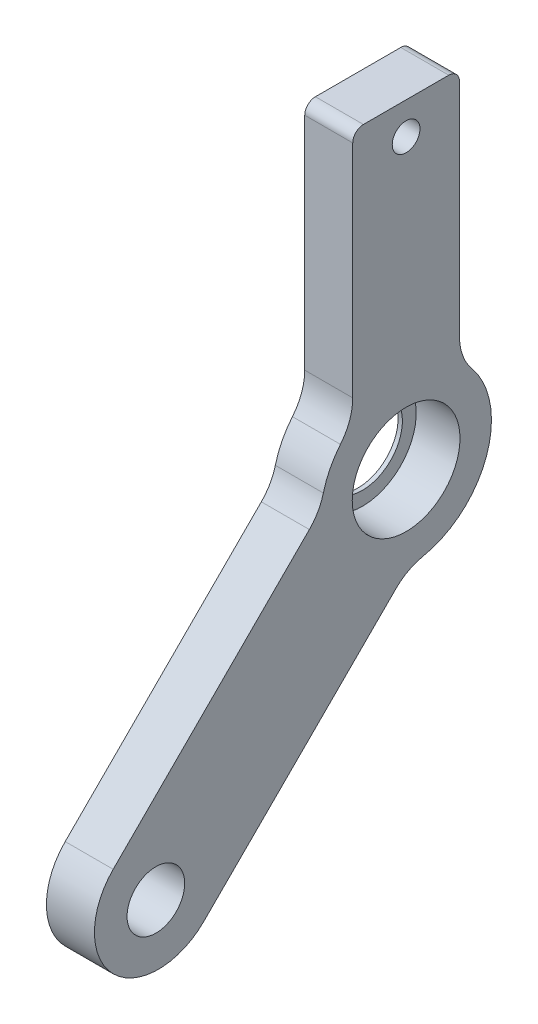
ISO-10303-21;
HEADER;
FILE_DESCRIPTION(('STEP AP214'),'2;1');
FILE_NAME('part.step','',(''),(''),'','','');
FILE_SCHEMA(('AUTOMOTIVE_DESIGN { 1 0 10303 214 1 1 1 1 }'));
ENDSEC;
DATA;
#1=APPLICATION_CONTEXT('core data for automotive mechanical design processes');
#2=APPLICATION_PROTOCOL_DEFINITION('international standard','automotive_design',2000,#1);
#3=PRODUCT_CONTEXT('',#1,'mechanical');
#4=PRODUCT('Part','Part','',(#3));
#5=PRODUCT_RELATED_PRODUCT_CATEGORY('part','',(#4));
#6=PRODUCT_DEFINITION_FORMATION('','',#4);
#7=PRODUCT_DEFINITION_CONTEXT('part definition',#1,'design');
#8=PRODUCT_DEFINITION('design','',#6,#7);
#9=PRODUCT_DEFINITION_SHAPE('','',#8);
#10=(LENGTH_UNIT() NAMED_UNIT(*) SI_UNIT(.MILLI.,.METRE.));
#11=(NAMED_UNIT(*) PLANE_ANGLE_UNIT() SI_UNIT($,.RADIAN.));
#12=(NAMED_UNIT(*) SI_UNIT($,.STERADIAN.) SOLID_ANGLE_UNIT());
#13=UNCERTAINTY_MEASURE_WITH_UNIT(LENGTH_MEASURE(1.E-05),#10,'distance_accuracy_value','');
#14=(GEOMETRIC_REPRESENTATION_CONTEXT(3) GLOBAL_UNCERTAINTY_ASSIGNED_CONTEXT((#13)) GLOBAL_UNIT_ASSIGNED_CONTEXT((#10,
#11,#12)) REPRESENTATION_CONTEXT('',''));
#15=CARTESIAN_POINT('',(0.,0.,0.));
#16=DIRECTION('',(0.,0.,1.));
#17=DIRECTION('',(1.,0.,0.));
#18=AXIS2_PLACEMENT_3D('',#15,#16,#17);
#19=CARTESIAN_POINT('',(-2.25,-22.9735992364267,23.2093014968222));
#20=DIRECTION('',(1.,0.,0.));
#21=DIRECTION('',(0.,0.,-1.));
#22=AXIS2_PLACEMENT_3D('',#19,#20,#21);
#23=PLANE('',#22);
#24=CARTESIAN_POINT('',(-2.25,-22.9735992364267,23.2093014968222));
#25=DIRECTION('',(-1.,0.,0.));
#26=DIRECTION('',(0.,0.,-1.));
#27=AXIS2_PLACEMENT_3D('',#24,#25,#26);
#28=CIRCLE('',#27,6.);
#29=CARTESIAN_POINT('',(-2.25,-27.216239923546,18.9666608097029));
#30=VERTEX_POINT('',#29);
#31=CARTESIAN_POINT('',(-2.25,-18.7309585493074,27.4519421839415));
#32=VERTEX_POINT('',#31);
#33=EDGE_CURVE('E195',#30,#32,#28,.T.);
#34=ORIENTED_EDGE('',*,*,#33,.T.);
#35=DIRECTION('',(0.,0.707106781186548,-0.707106781186548));
#36=VECTOR('',#35,1.);
#37=CARTESIAN_POINT('',(-2.25,-0.346181931497273,9.06716556613136));
#38=LINE('',#37,#36);
#39=CARTESIAN_POINT('',(-2.25,-0.346181931497273,9.06716556613136));
#40=VERTEX_POINT('',#39);
#41=EDGE_CURVE('E113',#32,#40,#38,.T.);
#42=ORIENTED_EDGE('',*,*,#41,.T.);
#43=CARTESIAN_POINT('',(-2.25,3.18935197443546,12.6026994720641));
#44=DIRECTION('',(1.,0.,0.));
#45=DIRECTION('',(0.,0.,-1.));
#46=AXIS2_PLACEMENT_3D('',#43,#44,#45);
#47=CIRCLE('',#46,5.);
#48=CARTESIAN_POINT('',(-2.25,1.96267813811413,7.75550736742406));
#49=VERTEX_POINT('',#48);
#50=EDGE_CURVE('E229',#40,#49,#47,.T.);
#51=ORIENTED_EDGE('',*,*,#50,.T.);
#52=CARTESIAN_POINT('',(-2.25,0.,0.));
#53=DIRECTION('',(-1.,0.,0.));
#54=DIRECTION('',(0.,0.,1.));
#55=AXIS2_PLACEMENT_3D('',#52,#53,#54);
#56=CIRCLE('',#55,8.);
#57=CARTESIAN_POINT('',(-2.25,5.11176853102651,6.15384615384616));
#58=VERTEX_POINT('',#57);
#59=EDGE_CURVE('E248',#49,#58,#56,.T.);
#60=ORIENTED_EDGE('',*,*,#59,.T.);
#61=CARTESIAN_POINT('',(-2.25,8.30662386291807,10.));
#62=DIRECTION('',(1.,0.,0.));
#63=DIRECTION('',(0.,0.,1.));
#64=AXIS2_PLACEMENT_3D('',#61,#62,#63);
#65=CIRCLE('',#64,5.);
#66=CARTESIAN_POINT('',(-2.25,8.30662386291807,5.));
#67=VERTEX_POINT('',#66);
#68=EDGE_CURVE('E245',#58,#67,#65,.T.);
#69=ORIENTED_EDGE('',*,*,#68,.T.);
#70=DIRECTION('',(0.,1.,0.));
#71=VECTOR('',#70,1.);
#72=CARTESIAN_POINT('',(-2.25,8.30662386291807,5.));
#73=LINE('',#72,#71);
#74=CARTESIAN_POINT('',(-2.25,29.,5.));
#75=VERTEX_POINT('',#74);
#76=EDGE_CURVE('E247',#67,#75,#73,.T.);
#77=ORIENTED_EDGE('',*,*,#76,.T.);
#78=CARTESIAN_POINT('',(-2.25,29.,4.));
#79=DIRECTION('',(-1.,0.,0.));
#80=DIRECTION('',(0.,0.,1.));
#81=AXIS2_PLACEMENT_3D('',#78,#79,#80);
#82=CIRCLE('',#81,0.999999999999999);
#83=CARTESIAN_POINT('',(-2.25,30.,4.));
#84=VERTEX_POINT('',#83);
#85=EDGE_CURVE('E250',#75,#84,#82,.T.);
#86=ORIENTED_EDGE('',*,*,#85,.T.);
#87=DIRECTION('',(0.,0.,-1.));
#88=VECTOR('',#87,1.);
#89=CARTESIAN_POINT('',(-2.25,30.,-4.));
#90=LINE('',#89,#88);
#91=CARTESIAN_POINT('',(-2.25,30.,-4.));
#92=VERTEX_POINT('',#91);
#93=EDGE_CURVE('E256',#84,#92,#90,.T.);
#94=ORIENTED_EDGE('',*,*,#93,.T.);
#95=CARTESIAN_POINT('',(-2.25,29.,-4.));
#96=DIRECTION('',(-1.,0.,0.));
#97=DIRECTION('',(0.,0.,-1.));
#98=AXIS2_PLACEMENT_3D('',#95,#96,#97);
#99=CIRCLE('',#98,0.999999999999999);
#100=CARTESIAN_POINT('',(-2.25,29.,-5.));
#101=VERTEX_POINT('',#100);
#102=EDGE_CURVE('E258',#92,#101,#99,.T.);
#103=ORIENTED_EDGE('',*,*,#102,.T.);
#104=DIRECTION('',(0.,-1.,0.));
#105=VECTOR('',#104,1.);
#106=CARTESIAN_POINT('',(-2.25,8.30662386291807,-5.));
#107=LINE('',#106,#105);
#108=CARTESIAN_POINT('',(-2.25,8.30662386291807,-5.));
#109=VERTEX_POINT('',#108);
#110=EDGE_CURVE('E260',#101,#109,#107,.T.);
#111=ORIENTED_EDGE('',*,*,#110,.T.);
#112=CARTESIAN_POINT('',(-2.25,8.30662386291807,-10.));
#113=DIRECTION('',(1.,0.,0.));
#114=DIRECTION('',(0.,0.,-1.));
#115=AXIS2_PLACEMENT_3D('',#112,#113,#114);
#116=CIRCLE('',#115,5.);
#117=CARTESIAN_POINT('',(-2.25,5.11176853102651,-6.15384615384615));
#118=VERTEX_POINT('',#117);
#119=EDGE_CURVE('E150',#109,#118,#116,.T.);
#120=ORIENTED_EDGE('',*,*,#119,.T.);
#121=CARTESIAN_POINT('',(-2.25,0.,0.));
#122=DIRECTION('',(-1.,0.,0.));
#123=DIRECTION('',(0.,0.,1.));
#124=AXIS2_PLACEMENT_3D('',#121,#122,#123);
#125=CIRCLE('',#124,8.);
#126=CARTESIAN_POINT('',(-2.25,-7.8409890477926,-1.58710136802803));
#127=VERTEX_POINT('',#126);
#128=EDGE_CURVE('E144',#118,#127,#125,.T.);
#129=ORIENTED_EDGE('',*,*,#128,.T.);
#130=CARTESIAN_POINT('',(-2.25,-12.741607202663,-2.57903972304555));
#131=DIRECTION('',(1.,0.,0.));
#132=DIRECTION('',(0.,0.,1.));
#133=AXIS2_PLACEMENT_3D('',#130,#131,#132);
#134=CIRCLE('',#133,5.);
#135=CARTESIAN_POINT('',(-2.25,-9.20607329673024,0.956494182887188));
#136=VERTEX_POINT('',#135);
#137=EDGE_CURVE('E148',#127,#136,#134,.T.);
#138=ORIENTED_EDGE('',*,*,#137,.T.);
#139=DIRECTION('',(0.,-0.707106781186547,0.707106781186548));
#140=VECTOR('',#139,1.);
#141=CARTESIAN_POINT('',(-2.25,-9.20607329673024,0.956494182887187));
#142=LINE('',#141,#140);
#143=EDGE_CURVE('E52',#136,#30,#142,.T.);
#144=ORIENTED_EDGE('',*,*,#143,.T.);
#145=EDGE_LOOP('',(#34,#42,#51,#60,#69,#77,#86,#94,#103,#111,#120,#129,#138,#144));
#146=FACE_BOUND('',#145,.T.);
#147=CARTESIAN_POINT('',(-2.25,0.,0.));
#148=DIRECTION('',(-1.,0.,0.));
#149=DIRECTION('',(0.,0.,1.));
#150=AXIS2_PLACEMENT_3D('',#147,#148,#149);
#151=CIRCLE('',#150,3.75);
#152=CARTESIAN_POINT('',(-2.25,0.,3.75));
#153=VERTEX_POINT('',#152);
#154=EDGE_CURVE('E172',#153,#153,#151,.T.);
#155=ORIENTED_EDGE('',*,*,#154,.F.);
#156=EDGE_LOOP('',(#155));
#157=FACE_BOUND('',#156,.T.);
#158=CARTESIAN_POINT('',(-2.25,27.,0.));
#159=DIRECTION('',(-1.,0.,0.));
#160=DIRECTION('',(0.,0.,1.));
#161=AXIS2_PLACEMENT_3D('',#158,#159,#160);
#162=CIRCLE('',#161,1.3);
#163=CARTESIAN_POINT('',(-2.25,27.,1.3));
#164=VERTEX_POINT('',#163);
#165=EDGE_CURVE('E328',#164,#164,#162,.T.);
#166=ORIENTED_EDGE('',*,*,#165,.F.);
#167=EDGE_LOOP('',(#166));
#168=FACE_BOUND('',#167,.T.);
#169=CARTESIAN_POINT('',(-2.25,-23.2163750431964,23.4520773035919));
#170=DIRECTION('',(-1.,0.,0.));
#171=DIRECTION('',(0.,0.,1.));
#172=AXIS2_PLACEMENT_3D('',#169,#170,#171);
#173=CIRCLE('',#172,2.7);
#174=CARTESIAN_POINT('',(-2.25,-23.2163750431964,26.1520773035919));
#175=VERTEX_POINT('',#174);
#176=EDGE_CURVE('E322',#175,#175,#173,.T.);
#177=ORIENTED_EDGE('',*,*,#176,.F.);
#178=EDGE_LOOP('',(#177));
#179=FACE_BOUND('',#178,.T.);
#180=ADVANCED_FACE('F34',(#146,#157,#168,#179),#23,.F.);
#181=CARTESIAN_POINT('',(2.25,-22.9735992364267,23.2093014968222));
#182=DIRECTION('',(1.,0.,0.));
#183=DIRECTION('',(0.,0.,-1.));
#184=AXIS2_PLACEMENT_3D('',#181,#182,#183);
#185=PLANE('',#184);
#186=CARTESIAN_POINT('',(2.25,0.,0.));
#187=DIRECTION('',(-1.,0.,0.));
#188=DIRECTION('',(0.,0.,1.));
#189=AXIS2_PLACEMENT_3D('',#186,#187,#188);
#190=CIRCLE('',#189,5.05);
#191=CARTESIAN_POINT('',(2.25,0.,5.05));
#192=VERTEX_POINT('',#191);
#193=EDGE_CURVE('E316',#192,#192,#190,.T.);
#194=ORIENTED_EDGE('',*,*,#193,.T.);
#195=EDGE_LOOP('',(#194));
#196=FACE_BOUND('',#195,.T.);
#197=CARTESIAN_POINT('',(2.25,27.,0.));
#198=DIRECTION('',(-1.,0.,0.));
#199=DIRECTION('',(0.,0.,1.));
#200=AXIS2_PLACEMENT_3D('',#197,#198,#199);
#201=CIRCLE('',#200,1.3);
#202=CARTESIAN_POINT('',(2.25,27.,1.3));
#203=VERTEX_POINT('',#202);
#204=EDGE_CURVE('E325',#203,#203,#201,.T.);
#205=ORIENTED_EDGE('',*,*,#204,.T.);
#206=EDGE_LOOP('',(#205));
#207=FACE_BOUND('',#206,.T.);
#208=CARTESIAN_POINT('',(2.25,-22.9735992364267,23.2093014968222));
#209=DIRECTION('',(-1.,0.,0.));
#210=DIRECTION('',(0.,0.,-1.));
#211=AXIS2_PLACEMENT_3D('',#208,#209,#210);
#212=CIRCLE('',#211,6.);
#213=CARTESIAN_POINT('',(2.25,-27.216239923546,18.9666608097029));
#214=VERTEX_POINT('',#213);
#215=CARTESIAN_POINT('',(2.25,-18.7309585493074,27.4519421839415));
#216=VERTEX_POINT('',#215);
#217=EDGE_CURVE('E168',#214,#216,#212,.T.);
#218=ORIENTED_EDGE('',*,*,#217,.F.);
#219=DIRECTION('',(0.,-0.707106781186547,0.707106781186548));
#220=VECTOR('',#219,1.);
#221=CARTESIAN_POINT('',(2.25,-9.20607329673024,0.956494182887187));
#222=LINE('',#221,#220);
#223=CARTESIAN_POINT('',(2.25,-9.20607329673024,0.956494182887188));
#224=VERTEX_POINT('',#223);
#225=EDGE_CURVE('E105',#224,#214,#222,.T.);
#226=ORIENTED_EDGE('',*,*,#225,.F.);
#227=CARTESIAN_POINT('',(2.25,-12.741607202663,-2.57903972304555));
#228=DIRECTION('',(1.,0.,0.));
#229=DIRECTION('',(0.,0.,1.));
#230=AXIS2_PLACEMENT_3D('',#227,#228,#229);
#231=CIRCLE('',#230,5.);
#232=CARTESIAN_POINT('',(2.25,-7.8409890477926,-1.58710136802803));
#233=VERTEX_POINT('',#232);
#234=EDGE_CURVE('E99',#233,#224,#231,.T.);
#235=ORIENTED_EDGE('',*,*,#234,.F.);
#236=CARTESIAN_POINT('',(2.25,0.,0.));
#237=DIRECTION('',(-1.,0.,0.));
#238=DIRECTION('',(0.,0.,1.));
#239=AXIS2_PLACEMENT_3D('',#236,#237,#238);
#240=CIRCLE('',#239,8.);
#241=CARTESIAN_POINT('',(2.25,5.11176853102651,-6.15384615384615));
#242=VERTEX_POINT('',#241);
#243=EDGE_CURVE('E158',#242,#233,#240,.T.);
#244=ORIENTED_EDGE('',*,*,#243,.F.);
#245=CARTESIAN_POINT('',(2.25,8.30662386291807,-10.));
#246=DIRECTION('',(1.,0.,0.));
#247=DIRECTION('',(0.,0.,-1.));
#248=AXIS2_PLACEMENT_3D('',#245,#246,#247);
#249=CIRCLE('',#248,5.);
#250=CARTESIAN_POINT('',(2.25,8.30662386291807,-5.));
#251=VERTEX_POINT('',#250);
#252=EDGE_CURVE('E190',#251,#242,#249,.T.);
#253=ORIENTED_EDGE('',*,*,#252,.F.);
#254=DIRECTION('',(0.,-1.,0.));
#255=VECTOR('',#254,1.);
#256=CARTESIAN_POINT('',(2.25,8.30662386291807,-5.));
#257=LINE('',#256,#255);
#258=CARTESIAN_POINT('',(2.25,29.,-5.));
#259=VERTEX_POINT('',#258);
#260=EDGE_CURVE('E188',#259,#251,#257,.T.);
#261=ORIENTED_EDGE('',*,*,#260,.F.);
#262=CARTESIAN_POINT('',(2.25,29.,-4.));
#263=DIRECTION('',(-1.,0.,0.));
#264=DIRECTION('',(0.,0.,-1.));
#265=AXIS2_PLACEMENT_3D('',#262,#263,#264);
#266=CIRCLE('',#265,0.999999999999999);
#267=CARTESIAN_POINT('',(2.25,30.,-4.));
#268=VERTEX_POINT('',#267);
#269=EDGE_CURVE('E186',#268,#259,#266,.T.);
#270=ORIENTED_EDGE('',*,*,#269,.F.);
#271=DIRECTION('',(0.,0.,-1.));
#272=VECTOR('',#271,1.);
#273=CARTESIAN_POINT('',(2.25,30.,-4.));
#274=LINE('',#273,#272);
#275=CARTESIAN_POINT('',(2.25,30.,4.));
#276=VERTEX_POINT('',#275);
#277=EDGE_CURVE('E184',#276,#268,#274,.T.);
#278=ORIENTED_EDGE('',*,*,#277,.F.);
#279=CARTESIAN_POINT('',(2.25,29.,4.));
#280=DIRECTION('',(-1.,0.,0.));
#281=DIRECTION('',(0.,0.,1.));
#282=AXIS2_PLACEMENT_3D('',#279,#280,#281);
#283=CIRCLE('',#282,0.999999999999999);
#284=CARTESIAN_POINT('',(2.25,29.,5.));
#285=VERTEX_POINT('',#284);
#286=EDGE_CURVE('E182',#285,#276,#283,.T.);
#287=ORIENTED_EDGE('',*,*,#286,.F.);
#288=DIRECTION('',(0.,1.,0.));
#289=VECTOR('',#288,1.);
#290=CARTESIAN_POINT('',(2.25,8.30662386291807,5.));
#291=LINE('',#290,#289);
#292=CARTESIAN_POINT('',(2.25,8.30662386291807,5.));
#293=VERTEX_POINT('',#292);
#294=EDGE_CURVE('E180',#293,#285,#291,.T.);
#295=ORIENTED_EDGE('',*,*,#294,.F.);
#296=CARTESIAN_POINT('',(2.25,8.30662386291807,10.));
#297=DIRECTION('',(1.,0.,0.));
#298=DIRECTION('',(0.,0.,1.));
#299=AXIS2_PLACEMENT_3D('',#296,#297,#298);
#300=CIRCLE('',#299,5.);
#301=CARTESIAN_POINT('',(2.25,5.11176853102651,6.15384615384616));
#302=VERTEX_POINT('',#301);
#303=EDGE_CURVE('E178',#302,#293,#300,.T.);
#304=ORIENTED_EDGE('',*,*,#303,.F.);
#305=CARTESIAN_POINT('',(2.25,0.,0.));
#306=DIRECTION('',(-1.,0.,0.));
#307=DIRECTION('',(0.,0.,1.));
#308=AXIS2_PLACEMENT_3D('',#305,#306,#307);
#309=CIRCLE('',#308,8.);
#310=CARTESIAN_POINT('',(2.25,1.96267813811413,7.75550736742406));
#311=VERTEX_POINT('',#310);
#312=EDGE_CURVE('E176',#311,#302,#309,.T.);
#313=ORIENTED_EDGE('',*,*,#312,.F.);
#314=CARTESIAN_POINT('',(2.25,3.18935197443546,12.6026994720641));
#315=DIRECTION('',(1.,0.,0.));
#316=DIRECTION('',(0.,0.,-1.));
#317=AXIS2_PLACEMENT_3D('',#314,#315,#316);
#318=CIRCLE('',#317,5.);
#319=CARTESIAN_POINT('',(2.25,-0.346181931497273,9.06716556613136));
#320=VERTEX_POINT('',#319);
#321=EDGE_CURVE('E174',#320,#311,#318,.T.);
#322=ORIENTED_EDGE('',*,*,#321,.F.);
#323=DIRECTION('',(0.,0.707106781186548,-0.707106781186548));
#324=VECTOR('',#323,1.);
#325=CARTESIAN_POINT('',(2.25,-0.346181931497273,9.06716556613136));
#326=LINE('',#325,#324);
#327=EDGE_CURVE('E171',#216,#320,#326,.T.);
#328=ORIENTED_EDGE('',*,*,#327,.F.);
#329=EDGE_LOOP('',(#218,#226,#235,#244,#253,#261,#270,#278,#287,#295,#304,#313,#322,#328));
#330=FACE_BOUND('',#329,.T.);
#331=CARTESIAN_POINT('',(2.25,-23.2163750431964,23.4520773035919));
#332=DIRECTION('',(-1.,0.,0.));
#333=DIRECTION('',(0.,0.,1.));
#334=AXIS2_PLACEMENT_3D('',#331,#332,#333);
#335=CIRCLE('',#334,2.7);
#336=CARTESIAN_POINT('',(2.25,-23.2163750431964,26.1520773035919));
#337=VERTEX_POINT('',#336);
#338=EDGE_CURVE('E318',#337,#337,#335,.T.);
#339=ORIENTED_EDGE('',*,*,#338,.T.);
#340=EDGE_LOOP('',(#339));
#341=FACE_BOUND('',#340,.T.);
#342=ADVANCED_FACE('F233',(#196,#207,#330,#341),#185,.T.);
#343=CARTESIAN_POINT('',(-2.25,-22.9735992364267,23.2093014968222));
#344=DIRECTION('',(1.,0.,0.));
#345=DIRECTION('',(0.,0.,-1.));
#346=AXIS2_PLACEMENT_3D('',#343,#344,#345);
#347=CYLINDRICAL_SURFACE('',#346,6.);
#348=ORIENTED_EDGE('',*,*,#217,.T.);
#349=DIRECTION('',(1.,0.,0.));
#350=VECTOR('',#349,1.);
#351=CARTESIAN_POINT('',(-2.25,-18.7309585493074,27.4519421839415));
#352=LINE('',#351,#350);
#353=EDGE_CURVE('E11',#32,#216,#352,.T.);
#354=ORIENTED_EDGE('',*,*,#353,.F.);
#355=ORIENTED_EDGE('',*,*,#33,.F.);
#356=DIRECTION('',(1.,0.,0.));
#357=VECTOR('',#356,1.);
#358=CARTESIAN_POINT('',(-2.25,-27.216239923546,18.9666608097029));
#359=LINE('',#358,#357);
#360=EDGE_CURVE('E164',#30,#214,#359,.T.);
#361=ORIENTED_EDGE('',*,*,#360,.T.);
#362=EDGE_LOOP('',(#348,#354,#355,#361));
#363=FACE_BOUND('',#362,.T.);
#364=ADVANCED_FACE('F36',(#363),#347,.T.);
#365=CARTESIAN_POINT('',(-2.25,-0.346181931497273,9.06716556613136));
#366=DIRECTION('',(0.,-0.707106781186547,-0.707106781186547));
#367=DIRECTION('',(0.,0.707106781186548,-0.707106781186548));
#368=AXIS2_PLACEMENT_3D('',#365,#366,#367);
#369=PLANE('',#368);
#370=ORIENTED_EDGE('',*,*,#327,.T.);
#371=DIRECTION('',(1.,0.,0.));
#372=VECTOR('',#371,1.);
#373=CARTESIAN_POINT('',(-2.25,-0.346181931497273,9.06716556613136));
#374=LINE('',#373,#372);
#375=EDGE_CURVE('E44',#40,#320,#374,.T.);
#376=ORIENTED_EDGE('',*,*,#375,.F.);
#377=ORIENTED_EDGE('',*,*,#41,.F.);
#378=ORIENTED_EDGE('',*,*,#353,.T.);
#379=EDGE_LOOP('',(#370,#376,#377,#378));
#380=FACE_BOUND('',#379,.T.);
#381=ADVANCED_FACE('F382',(#380),#369,.F.);
#382=CARTESIAN_POINT('',(-2.25,3.18935197443546,12.6026994720641));
#383=DIRECTION('',(1.,0.,0.));
#384=DIRECTION('',(0.,0.,-1.));
#385=AXIS2_PLACEMENT_3D('',#382,#383,#384);
#386=CYLINDRICAL_SURFACE('',#385,5.);
#387=ORIENTED_EDGE('',*,*,#321,.T.);
#388=DIRECTION('',(1.,0.,0.));
#389=VECTOR('',#388,1.);
#390=CARTESIAN_POINT('',(-2.25,1.96267813811413,7.75550736742406));
#391=LINE('',#390,#389);
#392=EDGE_CURVE('E220',#49,#311,#391,.T.);
#393=ORIENTED_EDGE('',*,*,#392,.F.);
#394=ORIENTED_EDGE('',*,*,#50,.F.);
#395=ORIENTED_EDGE('',*,*,#375,.T.);
#396=EDGE_LOOP('',(#387,#393,#394,#395));
#397=FACE_BOUND('',#396,.T.);
#398=ADVANCED_FACE('F227',(#397),#386,.F.);
#399=CARTESIAN_POINT('',(-2.25,0.,0.));
#400=DIRECTION('',(1.,0.,0.));
#401=DIRECTION('',(0.,0.,-1.));
#402=AXIS2_PLACEMENT_3D('',#399,#400,#401);
#403=CYLINDRICAL_SURFACE('',#402,8.);
#404=ORIENTED_EDGE('',*,*,#312,.T.);
#405=DIRECTION('',(1.,0.,0.));
#406=VECTOR('',#405,1.);
#407=CARTESIAN_POINT('',(-2.25,5.11176853102651,6.15384615384616));
#408=LINE('',#407,#406);
#409=EDGE_CURVE('E217',#58,#302,#408,.T.);
#410=ORIENTED_EDGE('',*,*,#409,.F.);
#411=ORIENTED_EDGE('',*,*,#59,.F.);
#412=ORIENTED_EDGE('',*,*,#392,.T.);
#413=EDGE_LOOP('',(#404,#410,#411,#412));
#414=FACE_BOUND('',#413,.T.);
#415=ADVANCED_FACE('F239',(#414),#403,.T.);
#416=CARTESIAN_POINT('',(-2.25,8.30662386291807,10.));
#417=DIRECTION('',(1.,0.,0.));
#418=DIRECTION('',(0.,0.,-1.));
#419=AXIS2_PLACEMENT_3D('',#416,#417,#418);
#420=CYLINDRICAL_SURFACE('',#419,5.);
#421=ORIENTED_EDGE('',*,*,#303,.T.);
#422=DIRECTION('',(1.,0.,0.));
#423=VECTOR('',#422,1.);
#424=CARTESIAN_POINT('',(-2.25,8.30662386291807,5.));
#425=LINE('',#424,#423);
#426=EDGE_CURVE('E214',#67,#293,#425,.T.);
#427=ORIENTED_EDGE('',*,*,#426,.F.);
#428=ORIENTED_EDGE('',*,*,#68,.F.);
#429=ORIENTED_EDGE('',*,*,#409,.T.);
#430=EDGE_LOOP('',(#421,#427,#428,#429));
#431=FACE_BOUND('',#430,.T.);
#432=ADVANCED_FACE('F243',(#431),#420,.F.);
#433=CARTESIAN_POINT('',(-2.25,8.30662386291807,5.));
#434=DIRECTION('',(0.,0.,-1.));
#435=DIRECTION('',(-1.,0.,0.));
#436=AXIS2_PLACEMENT_3D('',#433,#434,#435);
#437=PLANE('',#436);
#438=ORIENTED_EDGE('',*,*,#294,.T.);
#439=DIRECTION('',(1.,0.,0.));
#440=VECTOR('',#439,1.);
#441=CARTESIAN_POINT('',(-2.25,29.,5.));
#442=LINE('',#441,#440);
#443=EDGE_CURVE('E211',#75,#285,#442,.T.);
#444=ORIENTED_EDGE('',*,*,#443,.F.);
#445=ORIENTED_EDGE('',*,*,#76,.F.);
#446=ORIENTED_EDGE('',*,*,#426,.T.);
#447=EDGE_LOOP('',(#438,#444,#445,#446));
#448=FACE_BOUND('',#447,.T.);
#449=ADVANCED_FACE('F404',(#448),#437,.F.);
#450=CARTESIAN_POINT('',(-2.25,29.,4.));
#451=DIRECTION('',(1.,0.,0.));
#452=DIRECTION('',(0.,0.,-1.));
#453=AXIS2_PLACEMENT_3D('',#450,#451,#452);
#454=CYLINDRICAL_SURFACE('',#453,0.999999999999999);
#455=ORIENTED_EDGE('',*,*,#286,.T.);
#456=DIRECTION('',(1.,0.,0.));
#457=VECTOR('',#456,1.);
#458=CARTESIAN_POINT('',(-2.25,30.,4.));
#459=LINE('',#458,#457);
#460=EDGE_CURVE('E208',#84,#276,#459,.T.);
#461=ORIENTED_EDGE('',*,*,#460,.F.);
#462=ORIENTED_EDGE('',*,*,#85,.F.);
#463=ORIENTED_EDGE('',*,*,#443,.T.);
#464=EDGE_LOOP('',(#455,#461,#462,#463));
#465=FACE_BOUND('',#464,.T.);
#466=ADVANCED_FACE('F411',(#465),#454,.T.);
#467=CARTESIAN_POINT('',(-2.25,30.,-4.));
#468=DIRECTION('',(0.,-1.,0.));
#469=DIRECTION('',(0.,0.,-1.));
#470=AXIS2_PLACEMENT_3D('',#467,#468,#469);
#471=PLANE('',#470);
#472=ORIENTED_EDGE('',*,*,#277,.T.);
#473=DIRECTION('',(1.,0.,0.));
#474=VECTOR('',#473,1.);
#475=CARTESIAN_POINT('',(-2.25,30.,-4.));
#476=LINE('',#475,#474);
#477=EDGE_CURVE('E205',#92,#268,#476,.T.);
#478=ORIENTED_EDGE('',*,*,#477,.F.);
#479=ORIENTED_EDGE('',*,*,#93,.F.);
#480=ORIENTED_EDGE('',*,*,#460,.T.);
#481=EDGE_LOOP('',(#472,#478,#479,#480));
#482=FACE_BOUND('',#481,.T.);
#483=ADVANCED_FACE('F419',(#482),#471,.F.);
#484=CARTESIAN_POINT('',(-2.25,29.,-4.));
#485=DIRECTION('',(1.,0.,0.));
#486=DIRECTION('',(0.,0.,-1.));
#487=AXIS2_PLACEMENT_3D('',#484,#485,#486);
#488=CYLINDRICAL_SURFACE('',#487,0.999999999999999);
#489=ORIENTED_EDGE('',*,*,#269,.T.);
#490=DIRECTION('',(1.,0.,0.));
#491=VECTOR('',#490,1.);
#492=CARTESIAN_POINT('',(-2.25,29.,-5.));
#493=LINE('',#492,#491);
#494=EDGE_CURVE('E202',#101,#259,#493,.T.);
#495=ORIENTED_EDGE('',*,*,#494,.F.);
#496=ORIENTED_EDGE('',*,*,#102,.F.);
#497=ORIENTED_EDGE('',*,*,#477,.T.);
#498=EDGE_LOOP('',(#489,#495,#496,#497));
#499=FACE_BOUND('',#498,.T.);
#500=ADVANCED_FACE('F427',(#499),#488,.T.);
#501=CARTESIAN_POINT('',(-2.25,8.30662386291807,-5.));
#502=DIRECTION('',(0.,0.,1.));
#503=DIRECTION('',(1.,0.,0.));
#504=AXIS2_PLACEMENT_3D('',#501,#502,#503);
#505=PLANE('',#504);
#506=ORIENTED_EDGE('',*,*,#260,.T.);
#507=DIRECTION('',(1.,0.,0.));
#508=VECTOR('',#507,1.);
#509=CARTESIAN_POINT('',(-2.25,8.30662386291807,-5.));
#510=LINE('',#509,#508);
#511=EDGE_CURVE('E199',#109,#251,#510,.T.);
#512=ORIENTED_EDGE('',*,*,#511,.F.);
#513=ORIENTED_EDGE('',*,*,#110,.F.);
#514=ORIENTED_EDGE('',*,*,#494,.T.);
#515=EDGE_LOOP('',(#506,#512,#513,#514));
#516=FACE_BOUND('',#515,.T.);
#517=ADVANCED_FACE('F266',(#516),#505,.F.);
#518=CARTESIAN_POINT('',(-2.25,8.30662386291807,-10.));
#519=DIRECTION('',(1.,0.,0.));
#520=DIRECTION('',(0.,0.,-1.));
#521=AXIS2_PLACEMENT_3D('',#518,#519,#520);
#522=CYLINDRICAL_SURFACE('',#521,5.);
#523=ORIENTED_EDGE('',*,*,#252,.T.);
#524=DIRECTION('',(1.,0.,0.));
#525=VECTOR('',#524,1.);
#526=CARTESIAN_POINT('',(-2.25,5.11176853102651,-6.15384615384615));
#527=LINE('',#526,#525);
#528=EDGE_CURVE('E159',#118,#242,#527,.T.);
#529=ORIENTED_EDGE('',*,*,#528,.F.);
#530=ORIENTED_EDGE('',*,*,#119,.F.);
#531=ORIENTED_EDGE('',*,*,#511,.T.);
#532=EDGE_LOOP('',(#523,#529,#530,#531));
#533=FACE_BOUND('',#532,.T.);
#534=ADVANCED_FACE('F270',(#533),#522,.F.);
#535=CARTESIAN_POINT('',(-2.25,0.,0.));
#536=DIRECTION('',(1.,0.,0.));
#537=DIRECTION('',(0.,0.,-1.));
#538=AXIS2_PLACEMENT_3D('',#535,#536,#537);
#539=CYLINDRICAL_SURFACE('',#538,8.);
#540=ORIENTED_EDGE('',*,*,#243,.T.);
#541=DIRECTION('',(1.,0.,0.));
#542=VECTOR('',#541,1.);
#543=CARTESIAN_POINT('',(-2.25,-7.8409890477926,-1.58710136802803));
#544=LINE('',#543,#542);
#545=EDGE_CURVE('E155',#127,#233,#544,.T.);
#546=ORIENTED_EDGE('',*,*,#545,.F.);
#547=ORIENTED_EDGE('',*,*,#128,.F.);
#548=ORIENTED_EDGE('',*,*,#528,.T.);
#549=EDGE_LOOP('',(#540,#546,#547,#548));
#550=FACE_BOUND('',#549,.T.);
#551=ADVANCED_FACE('F156',(#550),#539,.T.);
#552=CARTESIAN_POINT('',(-2.25,-12.741607202663,-2.57903972304555));
#553=DIRECTION('',(1.,0.,0.));
#554=DIRECTION('',(0.,0.,-1.));
#555=AXIS2_PLACEMENT_3D('',#552,#553,#554);
#556=CYLINDRICAL_SURFACE('',#555,5.);
#557=ORIENTED_EDGE('',*,*,#234,.T.);
#558=DIRECTION('',(1.,0.,0.));
#559=VECTOR('',#558,1.);
#560=CARTESIAN_POINT('',(-2.25,-9.20607329673024,0.956494182887188));
#561=LINE('',#560,#559);
#562=EDGE_CURVE('E160',#136,#224,#561,.T.);
#563=ORIENTED_EDGE('',*,*,#562,.F.);
#564=ORIENTED_EDGE('',*,*,#137,.F.);
#565=ORIENTED_EDGE('',*,*,#545,.T.);
#566=EDGE_LOOP('',(#557,#563,#564,#565));
#567=FACE_BOUND('',#566,.T.);
#568=ADVANCED_FACE('F162',(#567),#556,.F.);
#569=CARTESIAN_POINT('',(-2.25,-9.20607329673024,0.956494182887187));
#570=DIRECTION('',(0.,0.707106781186548,0.707106781186547));
#571=DIRECTION('',(0.,-0.707106781186547,0.707106781186548));
#572=AXIS2_PLACEMENT_3D('',#569,#570,#571);
#573=PLANE('',#572);
#574=ORIENTED_EDGE('',*,*,#225,.T.);
#575=ORIENTED_EDGE('',*,*,#360,.F.);
#576=ORIENTED_EDGE('',*,*,#143,.F.);
#577=ORIENTED_EDGE('',*,*,#562,.T.);
#578=EDGE_LOOP('',(#574,#575,#576,#577));
#579=FACE_BOUND('',#578,.T.);
#580=ADVANCED_FACE('F274',(#579),#573,.F.);
#581=CARTESIAN_POINT('',(-2.25,0.,0.));
#582=DIRECTION('',(1.,0.,0.));
#583=DIRECTION('',(0.,0.,-1.));
#584=AXIS2_PLACEMENT_3D('',#581,#582,#583);
#585=CYLINDRICAL_SURFACE('',#584,3.75);
#586=CARTESIAN_POINT('',(-1.85,0.,0.));
#587=DIRECTION('',(-1.,0.,0.));
#588=DIRECTION('',(0.,0.,1.));
#589=AXIS2_PLACEMENT_3D('',#586,#587,#588);
#590=CIRCLE('',#589,3.75);
#591=CARTESIAN_POINT('',(-1.85,0.,3.75));
#592=VERTEX_POINT('',#591);
#593=EDGE_CURVE('E38',#592,#592,#590,.T.);
#594=ORIENTED_EDGE('',*,*,#593,.F.);
#595=EDGE_LOOP('',(#594));
#596=FACE_BOUND('',#595,.T.);
#597=ORIENTED_EDGE('',*,*,#154,.T.);
#598=EDGE_LOOP('',(#597));
#599=FACE_BOUND('',#598,.T.);
#600=ADVANCED_FACE('F276',(#596,#599),#585,.F.);
#601=CARTESIAN_POINT('',(-2.25,27.,0.));
#602=DIRECTION('',(1.,0.,0.));
#603=DIRECTION('',(0.,0.,-1.));
#604=AXIS2_PLACEMENT_3D('',#601,#602,#603);
#605=CYLINDRICAL_SURFACE('',#604,1.3);
#606=ORIENTED_EDGE('',*,*,#165,.T.);
#607=EDGE_LOOP('',(#606));
#608=FACE_BOUND('',#607,.T.);
#609=ORIENTED_EDGE('',*,*,#204,.F.);
#610=EDGE_LOOP('',(#609));
#611=FACE_BOUND('',#610,.T.);
#612=ADVANCED_FACE('F282',(#608,#611),#605,.F.);
#613=CARTESIAN_POINT('',(-2.25,-23.2163750431964,23.4520773035919));
#614=DIRECTION('',(1.,0.,0.));
#615=DIRECTION('',(0.,0.,-1.));
#616=AXIS2_PLACEMENT_3D('',#613,#614,#615);
#617=CYLINDRICAL_SURFACE('',#616,2.7);
#618=ORIENTED_EDGE('',*,*,#176,.T.);
#619=EDGE_LOOP('',(#618));
#620=FACE_BOUND('',#619,.T.);
#621=ORIENTED_EDGE('',*,*,#338,.F.);
#622=EDGE_LOOP('',(#621));
#623=FACE_BOUND('',#622,.T.);
#624=ADVANCED_FACE('F296',(#620,#623),#617,.F.);
#625=CARTESIAN_POINT('',(-1.85,0.,0.));
#626=DIRECTION('',(1.,0.,0.));
#627=DIRECTION('',(0.,0.,-1.));
#628=AXIS2_PLACEMENT_3D('',#625,#626,#627);
#629=CYLINDRICAL_SURFACE('',#628,5.05);
#630=CARTESIAN_POINT('',(-1.85,0.,0.));
#631=DIRECTION('',(-1.,0.,0.));
#632=DIRECTION('',(0.,0.,1.));
#633=AXIS2_PLACEMENT_3D('',#630,#631,#632);
#634=CIRCLE('',#633,5.05);
#635=CARTESIAN_POINT('',(-1.85,0.,5.05));
#636=VERTEX_POINT('',#635);
#637=EDGE_CURVE('E315',#636,#636,#634,.T.);
#638=ORIENTED_EDGE('',*,*,#637,.T.);
#639=EDGE_LOOP('',(#638));
#640=FACE_BOUND('',#639,.T.);
#641=ORIENTED_EDGE('',*,*,#193,.F.);
#642=EDGE_LOOP('',(#641));
#643=FACE_BOUND('',#642,.T.);
#644=ADVANCED_FACE('F300',(#640,#643),#629,.F.);
#645=CARTESIAN_POINT('',(-1.85,0.,0.));
#646=DIRECTION('',(-1.,0.,0.));
#647=DIRECTION('',(0.,0.,1.));
#648=AXIS2_PLACEMENT_3D('',#645,#646,#647);
#649=PLANE('',#648);
#650=ORIENTED_EDGE('',*,*,#593,.T.);
#651=EDGE_LOOP('',(#650));
#652=FACE_BOUND('',#651,.T.);
#653=ORIENTED_EDGE('',*,*,#637,.F.);
#654=EDGE_LOOP('',(#653));
#655=FACE_BOUND('',#654,.T.);
#656=ADVANCED_FACE('F304',(#652,#655),#649,.F.);
#657=CLOSED_SHELL('',(#180,#342,#364,#381,#398,#415,#432,#449,#466,#483,#500,#517,#534,#551,
#568,#580,#600,#612,#624,#644,#656));
#658=MANIFOLD_SOLID_BREP('B2',#657);
#659=ADVANCED_BREP_SHAPE_REPRESENTATION('',(#18,#658),#14);
#660=SHAPE_DEFINITION_REPRESENTATION(#9,#659);
ENDSEC;
END-ISO-10303-21;
